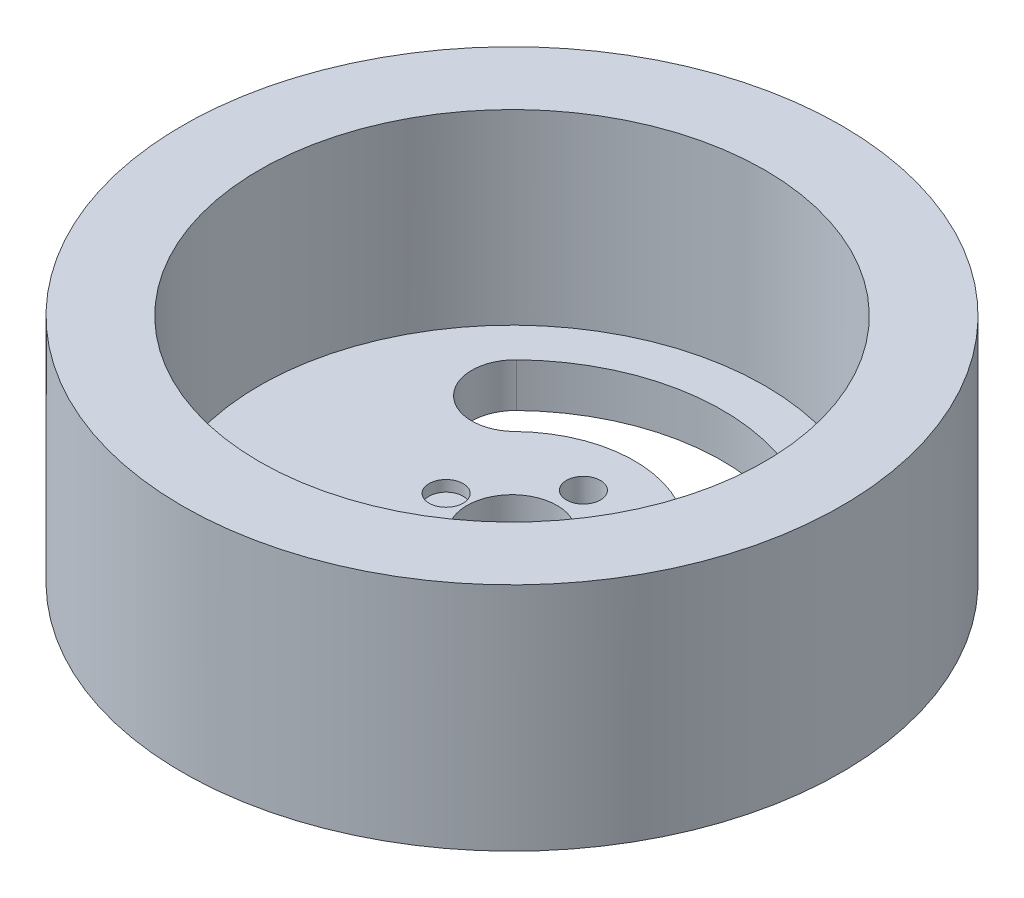
ISO-10303-21;
HEADER;
FILE_DESCRIPTION(('STEP AP214'),'2;1');
FILE_NAME('part.step','',(''),(''),'','','');
FILE_SCHEMA(('AUTOMOTIVE_DESIGN { 1 0 10303 214 1 1 1 1 }'));
ENDSEC;
DATA;
#1=APPLICATION_CONTEXT('core data for automotive mechanical design processes');
#2=APPLICATION_PROTOCOL_DEFINITION('international standard','automotive_design',2000,#1);
#3=PRODUCT_CONTEXT('',#1,'mechanical');
#4=PRODUCT('Part','Part','',(#3));
#5=PRODUCT_RELATED_PRODUCT_CATEGORY('part','',(#4));
#6=PRODUCT_DEFINITION_FORMATION('','',#4);
#7=PRODUCT_DEFINITION_CONTEXT('part definition',#1,'design');
#8=PRODUCT_DEFINITION('design','',#6,#7);
#9=PRODUCT_DEFINITION_SHAPE('','',#8);
#10=(LENGTH_UNIT() NAMED_UNIT(*) SI_UNIT(.MILLI.,.METRE.));
#11=(NAMED_UNIT(*) PLANE_ANGLE_UNIT() SI_UNIT($,.RADIAN.));
#12=(NAMED_UNIT(*) SI_UNIT($,.STERADIAN.) SOLID_ANGLE_UNIT());
#13=UNCERTAINTY_MEASURE_WITH_UNIT(LENGTH_MEASURE(1.E-05),#10,'distance_accuracy_value','');
#14=(GEOMETRIC_REPRESENTATION_CONTEXT(3) GLOBAL_UNCERTAINTY_ASSIGNED_CONTEXT((#13)) GLOBAL_UNIT_ASSIGNED_CONTEXT((#10,
#11,#12)) REPRESENTATION_CONTEXT('',''));
#15=CARTESIAN_POINT('',(0.,0.,0.));
#16=DIRECTION('',(0.,0.,1.));
#17=DIRECTION('',(1.,0.,0.));
#18=AXIS2_PLACEMENT_3D('',#15,#16,#17);
#19=CARTESIAN_POINT('',(0.,21.,0.));
#20=DIRECTION('',(0.,-1.,0.));
#21=DIRECTION('',(0.,0.,-1.));
#22=AXIS2_PLACEMENT_3D('',#19,#20,#21);
#23=CYLINDRICAL_SURFACE('',#22,23.);
#24=CARTESIAN_POINT('',(0.,1.,0.));
#25=DIRECTION('',(0.,-1.,0.));
#26=DIRECTION('',(0.,0.,-1.));
#27=AXIS2_PLACEMENT_3D('',#24,#25,#26);
#28=CIRCLE('',#27,23.);
#29=CARTESIAN_POINT('',(0.,1.,-23.));
#30=VERTEX_POINT('',#29);
#31=EDGE_CURVE('E11',#30,#30,#28,.T.);
#32=ORIENTED_EDGE('',*,*,#31,.T.);
#33=EDGE_LOOP('',(#32));
#34=FACE_BOUND('',#33,.T.);
#35=CARTESIAN_POINT('',(0.,18.,0.));
#36=DIRECTION('',(0.,1.,0.));
#37=DIRECTION('',(0.,0.,1.));
#38=AXIS2_PLACEMENT_3D('',#35,#36,#37);
#39=CIRCLE('',#38,23.);
#40=CARTESIAN_POINT('',(0.,18.,23.));
#41=VERTEX_POINT('',#40);
#42=EDGE_CURVE('E119',#41,#41,#39,.T.);
#43=ORIENTED_EDGE('',*,*,#42,.T.);
#44=EDGE_LOOP('',(#43));
#45=FACE_BOUND('',#44,.T.);
#46=ADVANCED_FACE('F36',(#34,#45),#23,.F.);
#47=CARTESIAN_POINT('',(0.,21.,0.));
#48=DIRECTION('',(0.,-1.,0.));
#49=DIRECTION('',(0.,0.,-1.));
#50=AXIS2_PLACEMENT_3D('',#47,#48,#49);
#51=CYLINDRICAL_SURFACE('',#50,30.);
#52=CARTESIAN_POINT('',(0.,-3.,0.));
#53=DIRECTION('',(0.,-1.,0.));
#54=DIRECTION('',(0.,0.,-1.));
#55=AXIS2_PLACEMENT_3D('',#52,#53,#54);
#56=CIRCLE('',#55,30.);
#57=CARTESIAN_POINT('',(0.,-3.,-30.));
#58=VERTEX_POINT('',#57);
#59=EDGE_CURVE('E154',#58,#58,#56,.T.);
#60=ORIENTED_EDGE('',*,*,#59,.F.);
#61=EDGE_LOOP('',(#60));
#62=FACE_BOUND('',#61,.T.);
#63=CARTESIAN_POINT('',(0.,18.,0.));
#64=DIRECTION('',(0.,1.,0.));
#65=DIRECTION('',(0.,0.,1.));
#66=AXIS2_PLACEMENT_3D('',#63,#64,#65);
#67=CIRCLE('',#66,30.);
#68=CARTESIAN_POINT('',(0.,18.,30.));
#69=VERTEX_POINT('',#68);
#70=EDGE_CURVE('E219',#69,#69,#67,.T.);
#71=ORIENTED_EDGE('',*,*,#70,.F.);
#72=EDGE_LOOP('',(#71));
#73=FACE_BOUND('',#72,.T.);
#74=ADVANCED_FACE('F38',(#62,#73),#51,.T.);
#75=CARTESIAN_POINT('',(0.,1.,0.));
#76=DIRECTION('',(0.,-1.,0.));
#77=DIRECTION('',(0.,0.,-1.));
#78=AXIS2_PLACEMENT_3D('',#75,#76,#77);
#79=PLANE('',#78);
#80=CARTESIAN_POINT('',(0.,1.,-6.5));
#81=DIRECTION('',(0.,-1.,0.));
#82=DIRECTION('',(0.,0.,-1.));
#83=AXIS2_PLACEMENT_3D('',#80,#81,#82);
#84=CIRCLE('',#83,1.55);
#85=CARTESIAN_POINT('',(0.,1.,-8.05));
#86=VERTEX_POINT('',#85);
#87=EDGE_CURVE('E158',#86,#86,#84,.T.);
#88=ORIENTED_EDGE('',*,*,#87,.T.);
#89=EDGE_LOOP('',(#88));
#90=FACE_BOUND('',#89,.T.);
#91=CARTESIAN_POINT('',(0.,1.,6.5));
#92=DIRECTION('',(0.,-1.,0.));
#93=DIRECTION('',(0.,0.,-1.));
#94=AXIS2_PLACEMENT_3D('',#91,#92,#93);
#95=CIRCLE('',#94,1.55);
#96=CARTESIAN_POINT('',(0.,1.,4.95));
#97=VERTEX_POINT('',#96);
#98=EDGE_CURVE('E161',#97,#97,#95,.T.);
#99=ORIENTED_EDGE('',*,*,#98,.T.);
#100=EDGE_LOOP('',(#99));
#101=FACE_BOUND('',#100,.T.);
#102=CARTESIAN_POINT('',(-6.,1.,0.));
#103=DIRECTION('',(0.,-1.,0.));
#104=DIRECTION('',(0.,0.,-1.));
#105=AXIS2_PLACEMENT_3D('',#102,#103,#104);
#106=CIRCLE('',#105,1.55);
#107=CARTESIAN_POINT('',(-6.,1.,-1.55));
#108=VERTEX_POINT('',#107);
#109=EDGE_CURVE('E164',#108,#108,#106,.T.);
#110=ORIENTED_EDGE('',*,*,#109,.T.);
#111=EDGE_LOOP('',(#110));
#112=FACE_BOUND('',#111,.T.);
#113=CARTESIAN_POINT('',(6.,1.,0.));
#114=DIRECTION('',(0.,-1.,0.));
#115=DIRECTION('',(0.,0.,-1.));
#116=AXIS2_PLACEMENT_3D('',#113,#114,#115);
#117=CIRCLE('',#116,1.55);
#118=CARTESIAN_POINT('',(6.,1.,-1.55));
#119=VERTEX_POINT('',#118);
#120=EDGE_CURVE('E167',#119,#119,#117,.T.);
#121=ORIENTED_EDGE('',*,*,#120,.T.);
#122=EDGE_LOOP('',(#121));
#123=FACE_BOUND('',#122,.T.);
#124=CARTESIAN_POINT('',(0.,1.,0.));
#125=DIRECTION('',(0.,-1.,0.));
#126=DIRECTION('',(0.,0.,-1.));
#127=AXIS2_PLACEMENT_3D('',#124,#125,#126);
#128=CIRCLE('',#127,4.1);
#129=CARTESIAN_POINT('',(0.,1.,-4.1));
#130=VERTEX_POINT('',#129);
#131=EDGE_CURVE('E172',#130,#130,#128,.T.);
#132=ORIENTED_EDGE('',*,*,#131,.T.);
#133=EDGE_LOOP('',(#132));
#134=FACE_BOUND('',#133,.T.);
#135=CARTESIAN_POINT('',(0.,1.,0.));
#136=DIRECTION('',(0.,-1.,0.));
#137=DIRECTION('',(0.,0.,1.));
#138=AXIS2_PLACEMENT_3D('',#135,#136,#137);
#139=CIRCLE('',#138,19.1434235402803);
#140=CARTESIAN_POINT('',(-13.3249758751776,1.,-13.7446601547108));
#141=VERTEX_POINT('',#140);
#142=CARTESIAN_POINT('',(13.7446601547108,1.,-13.3249758751776));
#143=VERTEX_POINT('',#142);
#144=EDGE_CURVE('E182',#141,#143,#139,.T.);
#145=ORIENTED_EDGE('',*,*,#144,.T.);
#146=CARTESIAN_POINT('',(10.8727265894757,1.,-10.5407349378886));
#147=DIRECTION('',(0.,-1.,0.));
#148=DIRECTION('',(0.,0.,1.));
#149=AXIS2_PLACEMENT_3D('',#146,#147,#148);
#150=CIRCLE('',#149,4.);
#151=CARTESIAN_POINT('',(8.00079302424056,1.,-7.75649400059958));
#152=VERTEX_POINT('',#151);
#153=EDGE_CURVE('E175',#143,#152,#150,.T.);
#154=ORIENTED_EDGE('',*,*,#153,.T.);
#155=CARTESIAN_POINT('',(0.,1.,0.));
#156=DIRECTION('',(0.,1.,0.));
#157=DIRECTION('',(0.,0.,1.));
#158=AXIS2_PLACEMENT_3D('',#155,#156,#157);
#159=CIRCLE('',#158,11.1434235402803);
#160=CARTESIAN_POINT('',(-7.75649400059958,1.,-8.00079302424056));
#161=VERTEX_POINT('',#160);
#162=EDGE_CURVE('E178',#152,#161,#159,.T.);
#163=ORIENTED_EDGE('',*,*,#162,.T.);
#164=CARTESIAN_POINT('',(-10.5407349378886,1.,-10.8727265894757));
#165=DIRECTION('',(0.,-1.,0.));
#166=DIRECTION('',(0.,0.,1.));
#167=AXIS2_PLACEMENT_3D('',#164,#165,#166);
#168=CIRCLE('',#167,4.);
#169=EDGE_CURVE('E51',#161,#141,#168,.T.);
#170=ORIENTED_EDGE('',*,*,#169,.T.);
#171=EDGE_LOOP('',(#145,#154,#163,#170));
#172=FACE_BOUND('',#171,.T.);
#173=CARTESIAN_POINT('',(0.,1.,0.));
#174=DIRECTION('',(0.,1.,0.));
#175=DIRECTION('',(0.,0.,-1.));
#176=AXIS2_PLACEMENT_3D('',#173,#174,#175);
#177=CIRCLE('',#176,11.1434235402803);
#178=CARTESIAN_POINT('',(-7.75649400059958,1.,8.00079302424056));
#179=VERTEX_POINT('',#178);
#180=CARTESIAN_POINT('',(8.00079302424056,1.,7.75649400059958));
#181=VERTEX_POINT('',#180);
#182=EDGE_CURVE('E198',#179,#181,#177,.T.);
#183=ORIENTED_EDGE('',*,*,#182,.T.);
#184=CARTESIAN_POINT('',(10.8727265894757,1.,10.5407349378886));
#185=DIRECTION('',(0.,-1.,0.));
#186=DIRECTION('',(0.,0.,-1.));
#187=AXIS2_PLACEMENT_3D('',#184,#185,#186);
#188=CIRCLE('',#187,4.);
#189=CARTESIAN_POINT('',(13.7446601547108,1.,13.3249758751776));
#190=VERTEX_POINT('',#189);
#191=EDGE_CURVE('E107',#181,#190,#188,.T.);
#192=ORIENTED_EDGE('',*,*,#191,.T.);
#193=CARTESIAN_POINT('',(0.,1.,0.));
#194=DIRECTION('',(0.,-1.,0.));
#195=DIRECTION('',(0.,0.,-1.));
#196=AXIS2_PLACEMENT_3D('',#193,#194,#195);
#197=CIRCLE('',#196,19.1434235402803);
#198=CARTESIAN_POINT('',(-13.3249758751776,1.,13.7446601547108));
#199=VERTEX_POINT('',#198);
#200=EDGE_CURVE('E194',#190,#199,#197,.T.);
#201=ORIENTED_EDGE('',*,*,#200,.T.);
#202=CARTESIAN_POINT('',(-10.5407349378886,1.,10.8727265894757));
#203=DIRECTION('',(0.,-1.,0.));
#204=DIRECTION('',(0.,0.,-1.));
#205=AXIS2_PLACEMENT_3D('',#202,#203,#204);
#206=CIRCLE('',#205,4.);
#207=EDGE_CURVE('E59',#199,#179,#206,.T.);
#208=ORIENTED_EDGE('',*,*,#207,.T.);
#209=EDGE_LOOP('',(#183,#192,#201,#208));
#210=FACE_BOUND('',#209,.T.);
#211=ORIENTED_EDGE('',*,*,#31,.F.);
#212=EDGE_LOOP('',(#211));
#213=FACE_BOUND('',#212,.T.);
#214=ADVANCED_FACE('F207',(#90,#101,#112,#123,#134,#172,#210,#213),#79,.F.);
#215=CARTESIAN_POINT('',(10.8727265894757,1.,10.5407349378886));
#216=DIRECTION('',(0.,-1.,0.));
#217=DIRECTION('',(0.,0.,-1.));
#218=AXIS2_PLACEMENT_3D('',#215,#216,#217);
#219=CYLINDRICAL_SURFACE('',#218,4.);
#220=DIRECTION('',(0.,-1.,0.));
#221=VECTOR('',#220,1.);
#222=CARTESIAN_POINT('',(8.00079302424056,1.,7.75649400059958));
#223=LINE('',#222,#221);
#224=CARTESIAN_POINT('',(8.00079302424056,-3.,7.75649400059958));
#225=VERTEX_POINT('',#224);
#226=EDGE_CURVE('E44',#181,#225,#223,.T.);
#227=ORIENTED_EDGE('',*,*,#226,.T.);
#228=CARTESIAN_POINT('',(10.8727265894757,-3.,10.5407349378886));
#229=DIRECTION('',(0.,-1.,0.));
#230=DIRECTION('',(0.,0.,-1.));
#231=AXIS2_PLACEMENT_3D('',#228,#229,#230);
#232=CIRCLE('',#231,4.);
#233=CARTESIAN_POINT('',(13.7446601547108,-3.,13.3249758751776));
#234=VERTEX_POINT('',#233);
#235=EDGE_CURVE('E104',#225,#234,#232,.T.);
#236=ORIENTED_EDGE('',*,*,#235,.T.);
#237=DIRECTION('',(0.,-1.,0.));
#238=VECTOR('',#237,1.);
#239=CARTESIAN_POINT('',(13.7446601547108,1.,13.3249758751776));
#240=LINE('',#239,#238);
#241=EDGE_CURVE('E199',#190,#234,#240,.T.);
#242=ORIENTED_EDGE('',*,*,#241,.F.);
#243=ORIENTED_EDGE('',*,*,#191,.F.);
#244=EDGE_LOOP('',(#227,#236,#242,#243));
#245=FACE_BOUND('',#244,.T.);
#246=ADVANCED_FACE('F102',(#245),#219,.F.);
#247=CARTESIAN_POINT('',(0.,1.,0.));
#248=DIRECTION('',(0.,-1.,0.));
#249=DIRECTION('',(0.,0.,-1.));
#250=AXIS2_PLACEMENT_3D('',#247,#248,#249);
#251=CYLINDRICAL_SURFACE('',#250,11.1434235402803);
#252=DIRECTION('',(0.,-1.,0.));
#253=VECTOR('',#252,1.);
#254=CARTESIAN_POINT('',(-7.75649400059958,1.,8.00079302424056));
#255=LINE('',#254,#253);
#256=CARTESIAN_POINT('',(-7.75649400059958,-3.,8.00079302424056));
#257=VERTEX_POINT('',#256);
#258=EDGE_CURVE('E111',#179,#257,#255,.T.);
#259=ORIENTED_EDGE('',*,*,#258,.T.);
#260=CARTESIAN_POINT('',(0.,-3.,0.));
#261=DIRECTION('',(0.,1.,0.));
#262=DIRECTION('',(0.,0.,-1.));
#263=AXIS2_PLACEMENT_3D('',#260,#261,#262);
#264=CIRCLE('',#263,11.1434235402803);
#265=EDGE_CURVE('E114',#257,#225,#264,.T.);
#266=ORIENTED_EDGE('',*,*,#265,.T.);
#267=ORIENTED_EDGE('',*,*,#226,.F.);
#268=ORIENTED_EDGE('',*,*,#182,.F.);
#269=EDGE_LOOP('',(#259,#266,#267,#268));
#270=FACE_BOUND('',#269,.T.);
#271=ADVANCED_FACE('F115',(#270),#251,.T.);
#272=CARTESIAN_POINT('',(-10.5407349378886,1.,10.8727265894757));
#273=DIRECTION('',(0.,-1.,0.));
#274=DIRECTION('',(0.,0.,-1.));
#275=AXIS2_PLACEMENT_3D('',#272,#273,#274);
#276=CYLINDRICAL_SURFACE('',#275,4.);
#277=DIRECTION('',(0.,-1.,0.));
#278=VECTOR('',#277,1.);
#279=CARTESIAN_POINT('',(-13.3249758751776,1.,13.7446601547108));
#280=LINE('',#279,#278);
#281=CARTESIAN_POINT('',(-13.3249758751776,-3.,13.7446601547108));
#282=VERTEX_POINT('',#281);
#283=EDGE_CURVE('E202',#199,#282,#280,.T.);
#284=ORIENTED_EDGE('',*,*,#283,.T.);
#285=CARTESIAN_POINT('',(-10.5407349378886,-3.,10.8727265894757));
#286=DIRECTION('',(0.,-1.,0.));
#287=DIRECTION('',(0.,0.,-1.));
#288=AXIS2_PLACEMENT_3D('',#285,#286,#287);
#289=CIRCLE('',#288,4.);
#290=EDGE_CURVE('E125',#282,#257,#289,.T.);
#291=ORIENTED_EDGE('',*,*,#290,.T.);
#292=ORIENTED_EDGE('',*,*,#258,.F.);
#293=ORIENTED_EDGE('',*,*,#207,.F.);
#294=EDGE_LOOP('',(#284,#291,#292,#293));
#295=FACE_BOUND('',#294,.T.);
#296=ADVANCED_FACE('F287',(#295),#276,.F.);
#297=CARTESIAN_POINT('',(0.,1.,0.));
#298=DIRECTION('',(0.,-1.,0.));
#299=DIRECTION('',(0.,0.,-1.));
#300=AXIS2_PLACEMENT_3D('',#297,#298,#299);
#301=CYLINDRICAL_SURFACE('',#300,19.1434235402803);
#302=ORIENTED_EDGE('',*,*,#241,.T.);
#303=CARTESIAN_POINT('',(0.,-3.,0.));
#304=DIRECTION('',(0.,-1.,0.));
#305=DIRECTION('',(0.,0.,-1.));
#306=AXIS2_PLACEMENT_3D('',#303,#304,#305);
#307=CIRCLE('',#306,19.1434235402803);
#308=EDGE_CURVE('E123',#234,#282,#307,.T.);
#309=ORIENTED_EDGE('',*,*,#308,.T.);
#310=ORIENTED_EDGE('',*,*,#283,.F.);
#311=ORIENTED_EDGE('',*,*,#200,.F.);
#312=EDGE_LOOP('',(#302,#309,#310,#311));
#313=FACE_BOUND('',#312,.T.);
#314=ADVANCED_FACE('F205',(#313),#301,.F.);
#315=CARTESIAN_POINT('',(10.8727265894757,1.,-10.5407349378886));
#316=DIRECTION('',(0.,-1.,0.));
#317=DIRECTION('',(0.,0.,-1.));
#318=AXIS2_PLACEMENT_3D('',#315,#316,#317);
#319=CYLINDRICAL_SURFACE('',#318,4.);
#320=DIRECTION('',(0.,-1.,0.));
#321=VECTOR('',#320,1.);
#322=CARTESIAN_POINT('',(13.7446601547108,1.,-13.3249758751776));
#323=LINE('',#322,#321);
#324=CARTESIAN_POINT('',(13.7446601547108,-3.,-13.3249758751776));
#325=VERTEX_POINT('',#324);
#326=EDGE_CURVE('E186',#143,#325,#323,.T.);
#327=ORIENTED_EDGE('',*,*,#326,.T.);
#328=CARTESIAN_POINT('',(10.8727265894757,-3.,-10.5407349378886));
#329=DIRECTION('',(0.,-1.,0.));
#330=DIRECTION('',(0.,0.,-1.));
#331=AXIS2_PLACEMENT_3D('',#328,#329,#330);
#332=CIRCLE('',#331,4.);
#333=CARTESIAN_POINT('',(8.00079302424056,-3.,-7.75649400059958));
#334=VERTEX_POINT('',#333);
#335=EDGE_CURVE('E151',#325,#334,#332,.T.);
#336=ORIENTED_EDGE('',*,*,#335,.T.);
#337=DIRECTION('',(0.,-1.,0.));
#338=VECTOR('',#337,1.);
#339=CARTESIAN_POINT('',(8.00079302424056,1.,-7.75649400059958));
#340=LINE('',#339,#338);
#341=EDGE_CURVE('E185',#152,#334,#340,.T.);
#342=ORIENTED_EDGE('',*,*,#341,.F.);
#343=ORIENTED_EDGE('',*,*,#153,.F.);
#344=EDGE_LOOP('',(#327,#336,#342,#343));
#345=FACE_BOUND('',#344,.T.);
#346=ADVANCED_FACE('F275',(#345),#319,.F.);
#347=CARTESIAN_POINT('',(0.,1.,0.));
#348=DIRECTION('',(0.,-1.,0.));
#349=DIRECTION('',(0.,0.,-1.));
#350=AXIS2_PLACEMENT_3D('',#347,#348,#349);
#351=CYLINDRICAL_SURFACE('',#350,19.1434235402803);
#352=DIRECTION('',(0.,-1.,0.));
#353=VECTOR('',#352,1.);
#354=CARTESIAN_POINT('',(-13.3249758751776,1.,-13.7446601547108));
#355=LINE('',#354,#353);
#356=CARTESIAN_POINT('',(-13.3249758751776,-3.,-13.7446601547108));
#357=VERTEX_POINT('',#356);
#358=EDGE_CURVE('E188',#141,#357,#355,.T.);
#359=ORIENTED_EDGE('',*,*,#358,.T.);
#360=CARTESIAN_POINT('',(0.,-3.,0.));
#361=DIRECTION('',(0.,-1.,0.));
#362=DIRECTION('',(0.,0.,-1.));
#363=AXIS2_PLACEMENT_3D('',#360,#361,#362);
#364=CIRCLE('',#363,19.1434235402803);
#365=EDGE_CURVE('E148',#357,#325,#364,.T.);
#366=ORIENTED_EDGE('',*,*,#365,.T.);
#367=ORIENTED_EDGE('',*,*,#326,.F.);
#368=ORIENTED_EDGE('',*,*,#144,.F.);
#369=EDGE_LOOP('',(#359,#366,#367,#368));
#370=FACE_BOUND('',#369,.T.);
#371=ADVANCED_FACE('F271',(#370),#351,.F.);
#372=CARTESIAN_POINT('',(-10.5407349378886,1.,-10.8727265894757));
#373=DIRECTION('',(0.,-1.,0.));
#374=DIRECTION('',(0.,0.,-1.));
#375=AXIS2_PLACEMENT_3D('',#372,#373,#374);
#376=CYLINDRICAL_SURFACE('',#375,4.);
#377=DIRECTION('',(0.,-1.,0.));
#378=VECTOR('',#377,1.);
#379=CARTESIAN_POINT('',(-7.75649400059958,1.,-8.00079302424056));
#380=LINE('',#379,#378);
#381=CARTESIAN_POINT('',(-7.75649400059958,-3.,-8.00079302424056));
#382=VERTEX_POINT('',#381);
#383=EDGE_CURVE('E190',#161,#382,#380,.T.);
#384=ORIENTED_EDGE('',*,*,#383,.T.);
#385=CARTESIAN_POINT('',(-10.5407349378886,-3.,-10.8727265894757));
#386=DIRECTION('',(0.,-1.,0.));
#387=DIRECTION('',(0.,0.,-1.));
#388=AXIS2_PLACEMENT_3D('',#385,#386,#387);
#389=CIRCLE('',#388,4.);
#390=EDGE_CURVE('E145',#382,#357,#389,.T.);
#391=ORIENTED_EDGE('',*,*,#390,.T.);
#392=ORIENTED_EDGE('',*,*,#358,.F.);
#393=ORIENTED_EDGE('',*,*,#169,.F.);
#394=EDGE_LOOP('',(#384,#391,#392,#393));
#395=FACE_BOUND('',#394,.T.);
#396=ADVANCED_FACE('F274',(#395),#376,.F.);
#397=CARTESIAN_POINT('',(0.,1.,0.));
#398=DIRECTION('',(0.,-1.,0.));
#399=DIRECTION('',(0.,0.,-1.));
#400=AXIS2_PLACEMENT_3D('',#397,#398,#399);
#401=CYLINDRICAL_SURFACE('',#400,11.1434235402803);
#402=ORIENTED_EDGE('',*,*,#341,.T.);
#403=CARTESIAN_POINT('',(0.,-3.,0.));
#404=DIRECTION('',(0.,1.,0.));
#405=DIRECTION('',(0.,0.,-1.));
#406=AXIS2_PLACEMENT_3D('',#403,#404,#405);
#407=CIRCLE('',#406,11.1434235402803);
#408=EDGE_CURVE('E142',#334,#382,#407,.T.);
#409=ORIENTED_EDGE('',*,*,#408,.T.);
#410=ORIENTED_EDGE('',*,*,#383,.F.);
#411=ORIENTED_EDGE('',*,*,#162,.F.);
#412=EDGE_LOOP('',(#402,#409,#410,#411));
#413=FACE_BOUND('',#412,.T.);
#414=ADVANCED_FACE('F269',(#413),#401,.T.);
#415=CARTESIAN_POINT('',(0.,1.,0.));
#416=DIRECTION('',(0.,-1.,0.));
#417=DIRECTION('',(0.,0.,-1.));
#418=AXIS2_PLACEMENT_3D('',#415,#416,#417);
#419=CYLINDRICAL_SURFACE('',#418,4.1);
#420=ORIENTED_EDGE('',*,*,#131,.F.);
#421=EDGE_LOOP('',(#420));
#422=FACE_BOUND('',#421,.T.);
#423=CARTESIAN_POINT('',(0.,-3.,0.));
#424=DIRECTION('',(0.,-1.,0.));
#425=DIRECTION('',(0.,0.,-1.));
#426=AXIS2_PLACEMENT_3D('',#423,#424,#425);
#427=CIRCLE('',#426,4.1);
#428=CARTESIAN_POINT('',(0.,-3.,-4.1));
#429=VERTEX_POINT('',#428);
#430=EDGE_CURVE('E133',#429,#429,#427,.T.);
#431=ORIENTED_EDGE('',*,*,#430,.T.);
#432=EDGE_LOOP('',(#431));
#433=FACE_BOUND('',#432,.T.);
#434=ADVANCED_FACE('F265',(#422,#433),#419,.F.);
#435=CARTESIAN_POINT('',(6.,1.,0.));
#436=DIRECTION('',(0.,-1.,0.));
#437=DIRECTION('',(0.,0.,-1.));
#438=AXIS2_PLACEMENT_3D('',#435,#436,#437);
#439=CYLINDRICAL_SURFACE('',#438,1.55);
#440=ORIENTED_EDGE('',*,*,#120,.F.);
#441=EDGE_LOOP('',(#440));
#442=FACE_BOUND('',#441,.T.);
#443=CARTESIAN_POINT('',(6.,-3.,0.));
#444=DIRECTION('',(0.,-1.,0.));
#445=DIRECTION('',(0.,0.,-1.));
#446=AXIS2_PLACEMENT_3D('',#443,#444,#445);
#447=CIRCLE('',#446,1.55);
#448=CARTESIAN_POINT('',(6.,-3.,-1.55));
#449=VERTEX_POINT('',#448);
#450=EDGE_CURVE('E136',#449,#449,#447,.T.);
#451=ORIENTED_EDGE('',*,*,#450,.T.);
#452=EDGE_LOOP('',(#451));
#453=FACE_BOUND('',#452,.T.);
#454=ADVANCED_FACE('F257',(#442,#453),#439,.F.);
#455=CARTESIAN_POINT('',(-6.,1.,0.));
#456=DIRECTION('',(0.,-1.,0.));
#457=DIRECTION('',(0.,0.,-1.));
#458=AXIS2_PLACEMENT_3D('',#455,#456,#457);
#459=CYLINDRICAL_SURFACE('',#458,1.55);
#460=ORIENTED_EDGE('',*,*,#109,.F.);
#461=EDGE_LOOP('',(#460));
#462=FACE_BOUND('',#461,.T.);
#463=CARTESIAN_POINT('',(-6.,0.,0.));
#464=DIRECTION('',(0.,-1.,0.));
#465=DIRECTION('',(0.,0.,-1.));
#466=AXIS2_PLACEMENT_3D('',#463,#464,#465);
#467=CIRCLE('',#466,1.55);
#468=CARTESIAN_POINT('',(-6.,0.,-1.55));
#469=VERTEX_POINT('',#468);
#470=EDGE_CURVE('E157',#469,#469,#467,.T.);
#471=ORIENTED_EDGE('',*,*,#470,.T.);
#472=EDGE_LOOP('',(#471));
#473=FACE_BOUND('',#472,.T.);
#474=ADVANCED_FACE('F248',(#462,#473),#459,.F.);
#475=CARTESIAN_POINT('',(0.,1.,6.5));
#476=DIRECTION('',(0.,-1.,0.));
#477=DIRECTION('',(0.,0.,-1.));
#478=AXIS2_PLACEMENT_3D('',#475,#476,#477);
#479=CYLINDRICAL_SURFACE('',#478,1.55);
#480=ORIENTED_EDGE('',*,*,#98,.F.);
#481=EDGE_LOOP('',(#480));
#482=FACE_BOUND('',#481,.T.);
#483=CARTESIAN_POINT('',(0.,-3.,6.5));
#484=DIRECTION('',(0.,-1.,0.));
#485=DIRECTION('',(0.,0.,-1.));
#486=AXIS2_PLACEMENT_3D('',#483,#484,#485);
#487=CIRCLE('',#486,1.55);
#488=CARTESIAN_POINT('',(0.,-3.,4.95));
#489=VERTEX_POINT('',#488);
#490=EDGE_CURVE('E130',#489,#489,#487,.T.);
#491=ORIENTED_EDGE('',*,*,#490,.T.);
#492=EDGE_LOOP('',(#491));
#493=FACE_BOUND('',#492,.T.);
#494=ADVANCED_FACE('F245',(#482,#493),#479,.F.);
#495=CARTESIAN_POINT('',(0.,1.,-6.5));
#496=DIRECTION('',(0.,-1.,0.));
#497=DIRECTION('',(0.,0.,-1.));
#498=AXIS2_PLACEMENT_3D('',#495,#496,#497);
#499=CYLINDRICAL_SURFACE('',#498,1.55);
#500=ORIENTED_EDGE('',*,*,#87,.F.);
#501=EDGE_LOOP('',(#500));
#502=FACE_BOUND('',#501,.T.);
#503=CARTESIAN_POINT('',(0.,-3.,-6.5));
#504=DIRECTION('',(0.,-1.,0.));
#505=DIRECTION('',(0.,0.,-1.));
#506=AXIS2_PLACEMENT_3D('',#503,#504,#505);
#507=CIRCLE('',#506,1.55);
#508=CARTESIAN_POINT('',(0.,-3.,-8.05));
#509=VERTEX_POINT('',#508);
#510=EDGE_CURVE('E139',#509,#509,#507,.T.);
#511=ORIENTED_EDGE('',*,*,#510,.T.);
#512=EDGE_LOOP('',(#511));
#513=FACE_BOUND('',#512,.T.);
#514=ADVANCED_FACE('F247',(#502,#513),#499,.F.);
#515=CARTESIAN_POINT('',(0.,0.,0.));
#516=DIRECTION('',(0.,-1.,0.));
#517=DIRECTION('',(0.,0.,-1.));
#518=AXIS2_PLACEMENT_3D('',#515,#516,#517);
#519=PLANE('',#518);
#520=ORIENTED_EDGE('',*,*,#470,.F.);
#521=EDGE_LOOP('',(#520));
#522=FACE_BOUND('',#521,.T.);
#523=ADVANCED_FACE('F234',(#522),#519,.F.);
#524=CARTESIAN_POINT('',(0.,-3.,0.));
#525=DIRECTION('',(0.,-1.,0.));
#526=DIRECTION('',(0.,0.,-1.));
#527=AXIS2_PLACEMENT_3D('',#524,#525,#526);
#528=PLANE('',#527);
#529=ORIENTED_EDGE('',*,*,#430,.F.);
#530=EDGE_LOOP('',(#529));
#531=FACE_BOUND('',#530,.T.);
#532=ORIENTED_EDGE('',*,*,#510,.F.);
#533=EDGE_LOOP('',(#532));
#534=FACE_BOUND('',#533,.T.);
#535=ORIENTED_EDGE('',*,*,#59,.T.);
#536=EDGE_LOOP('',(#535));
#537=FACE_BOUND('',#536,.T.);
#538=ORIENTED_EDGE('',*,*,#390,.F.);
#539=ORIENTED_EDGE('',*,*,#408,.F.);
#540=ORIENTED_EDGE('',*,*,#335,.F.);
#541=ORIENTED_EDGE('',*,*,#365,.F.);
#542=EDGE_LOOP('',(#538,#539,#540,#541));
#543=FACE_BOUND('',#542,.T.);
#544=ORIENTED_EDGE('',*,*,#450,.F.);
#545=EDGE_LOOP('',(#544));
#546=FACE_BOUND('',#545,.T.);
#547=ORIENTED_EDGE('',*,*,#490,.F.);
#548=EDGE_LOOP('',(#547));
#549=FACE_BOUND('',#548,.T.);
#550=ORIENTED_EDGE('',*,*,#235,.F.);
#551=ORIENTED_EDGE('',*,*,#265,.F.);
#552=ORIENTED_EDGE('',*,*,#290,.F.);
#553=ORIENTED_EDGE('',*,*,#308,.F.);
#554=EDGE_LOOP('',(#550,#551,#552,#553));
#555=FACE_BOUND('',#554,.T.);
#556=ADVANCED_FACE('F121',(#531,#534,#537,#543,#546,#549,#555),#528,.T.);
#557=CARTESIAN_POINT('',(0.,18.,0.));
#558=DIRECTION('',(0.,1.,0.));
#559=DIRECTION('',(0.,0.,1.));
#560=AXIS2_PLACEMENT_3D('',#557,#558,#559);
#561=PLANE('',#560);
#562=ORIENTED_EDGE('',*,*,#42,.F.);
#563=EDGE_LOOP('',(#562));
#564=FACE_BOUND('',#563,.T.);
#565=ORIENTED_EDGE('',*,*,#70,.T.);
#566=EDGE_LOOP('',(#565));
#567=FACE_BOUND('',#566,.T.);
#568=ADVANCED_FACE('F224',(#564,#567),#561,.T.);
#569=CLOSED_SHELL('',(#46,#74,#214,#246,#271,#296,#314,#346,#371,#396,#414,#434,#454,#474,#494,
#514,#523,#556,#568));
#570=MANIFOLD_SOLID_BREP('B2',#569);
#571=ADVANCED_BREP_SHAPE_REPRESENTATION('',(#18,#570),#14);
#572=SHAPE_DEFINITION_REPRESENTATION(#9,#571);
ENDSEC;
END-ISO-10303-21;
